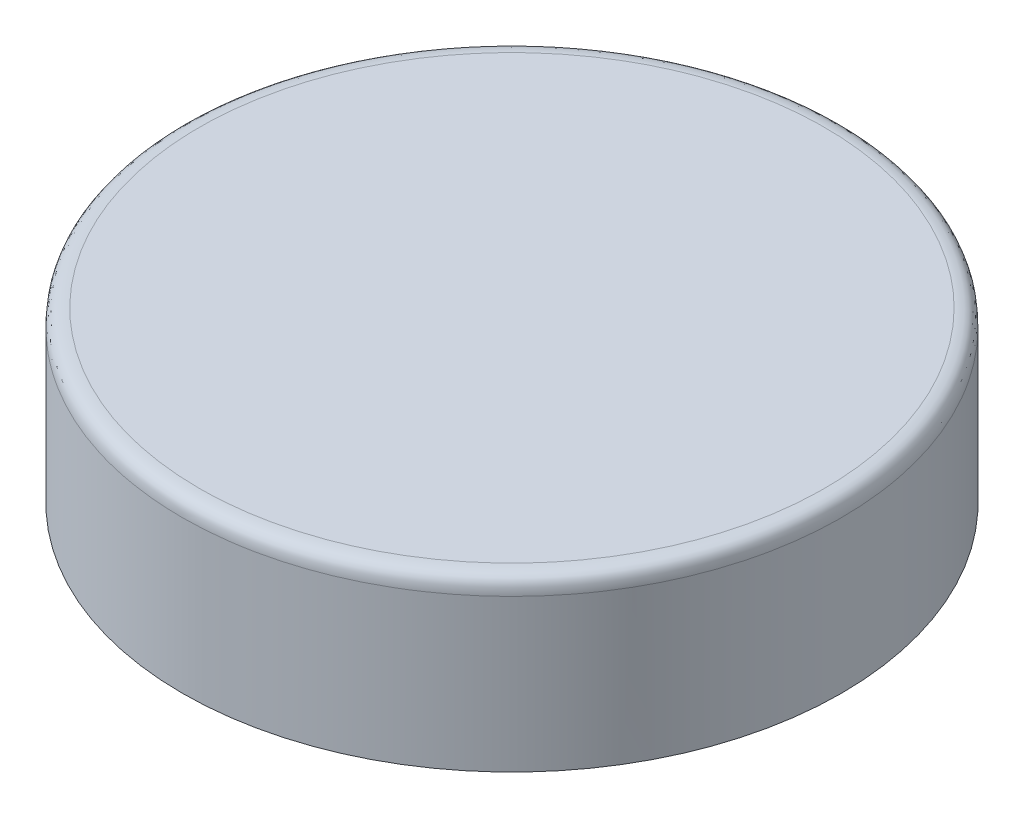
ISO-10303-21;
HEADER;
FILE_DESCRIPTION(('STEP AP214'),'2;1');
FILE_NAME('part.step','',(''),(''),'','','');
FILE_SCHEMA(('AUTOMOTIVE_DESIGN { 1 0 10303 214 1 1 1 1 }'));
ENDSEC;
DATA;
#1=APPLICATION_CONTEXT('core data for automotive mechanical design processes');
#2=APPLICATION_PROTOCOL_DEFINITION('international standard','automotive_design',2000,#1);
#3=PRODUCT_CONTEXT('',#1,'mechanical');
#4=PRODUCT('Part','Part','',(#3));
#5=PRODUCT_RELATED_PRODUCT_CATEGORY('part','',(#4));
#6=PRODUCT_DEFINITION_FORMATION('','',#4);
#7=PRODUCT_DEFINITION_CONTEXT('part definition',#1,'design');
#8=PRODUCT_DEFINITION('design','',#6,#7);
#9=PRODUCT_DEFINITION_SHAPE('','',#8);
#10=(LENGTH_UNIT() NAMED_UNIT(*) SI_UNIT(.MILLI.,.METRE.));
#11=(NAMED_UNIT(*) PLANE_ANGLE_UNIT() SI_UNIT($,.RADIAN.));
#12=(NAMED_UNIT(*) SI_UNIT($,.STERADIAN.) SOLID_ANGLE_UNIT());
#13=UNCERTAINTY_MEASURE_WITH_UNIT(LENGTH_MEASURE(1.E-05),#10,'distance_accuracy_value','');
#14=(GEOMETRIC_REPRESENTATION_CONTEXT(3) GLOBAL_UNCERTAINTY_ASSIGNED_CONTEXT((#13)) GLOBAL_UNIT_ASSIGNED_CONTEXT((#10,
#11,#12)) REPRESENTATION_CONTEXT('',''));
#15=CARTESIAN_POINT('',(0.,0.,0.));
#16=DIRECTION('',(0.,0.,1.));
#17=DIRECTION('',(1.,0.,0.));
#18=AXIS2_PLACEMENT_3D('',#15,#16,#17);
#19=CARTESIAN_POINT('',(34.0011574074074,18.7,-5.12392703793074));
#20=CARTESIAN_POINT('',(34.0011574074074,11.8999999999808,-5.12392703793074));
#21=CARTESIAN_POINT('',(34.0011574074074,5.1,-5.12392703793074));
#22=CARTESIAN_POINT('',(34.0011574074074,-1.7,-5.12392703793074));
#23=CARTESIAN_POINT('',(34.2320146256508,18.7,-5.21398437817317));
#24=CARTESIAN_POINT('',(34.2320146256508,11.8999999999808,-5.21398437817317));
#25=CARTESIAN_POINT('',(34.2320146256508,5.1,-5.21398437817317));
#26=CARTESIAN_POINT('',(34.2320146256508,-1.7,-5.21398437817317));
#27=CARTESIAN_POINT('',(34.493868674793,18.7,-5.30115351592212));
#28=CARTESIAN_POINT('',(34.493868674793,11.8999999999808,-5.30115351592212));
#29=CARTESIAN_POINT('',(34.493868674793,5.1,-5.30115351592212));
#30=CARTESIAN_POINT('',(34.493868674793,-1.7,-5.30115351592212));
#31=CARTESIAN_POINT('',(35.1290291317031,18.7,-5.66636233860913));
#32=CARTESIAN_POINT('',(35.1290291317031,11.8999999999808,-5.66636233860913));
#33=CARTESIAN_POINT('',(35.1290291317031,5.1,-5.66636233860913));
#34=CARTESIAN_POINT('',(35.1290291317031,-1.7,-5.66636233860913));
#35=CARTESIAN_POINT('',(35.3760401845032,18.7,-6.19211694788725));
#36=CARTESIAN_POINT('',(35.3760401845032,11.8999999999808,-6.19211694788725));
#37=CARTESIAN_POINT('',(35.3760401845032,5.1,-6.19211694788725));
#38=CARTESIAN_POINT('',(35.3760401845032,-1.7,-6.19211694788725));
#39=CARTESIAN_POINT('',(35.3507578582114,18.7,-6.81573477498469));
#40=CARTESIAN_POINT('',(35.3507578582114,11.8999999999808,-6.81573477498469));
#41=CARTESIAN_POINT('',(35.3507578582114,5.1,-6.81573477498469));
#42=CARTESIAN_POINT('',(35.3507578582114,-1.7,-6.81573477498469));
#43=CARTESIAN_POINT('',(35.2930109513593,18.7,-7.10581632505651));
#44=CARTESIAN_POINT('',(35.2930109513593,11.8999999999808,-7.10581632505651));
#45=CARTESIAN_POINT('',(35.2930109513593,5.1,-7.10581632505651));
#46=CARTESIAN_POINT('',(35.2930109513593,-1.7,-7.10581632505651));
#47=CARTESIAN_POINT('',(35.2316176470588,18.7,-7.39818342375026));
#48=CARTESIAN_POINT('',(35.2316176470588,11.8999999999808,-7.39818342375026));
#49=CARTESIAN_POINT('',(35.2316176470588,5.1,-7.39818342375026));
#50=CARTESIAN_POINT('',(35.2316176470588,-1.7,-7.39818342375026));
#51=B_SPLINE_SURFACE_WITH_KNOTS('',5,3,((#19,#20,#21,#22),(#23,#24,#25,#26),(#27,#28,#29,#30),
(#31,#32,#33,#34),(#35,#36,#37,#38),(#39,#40,#41,#42),(#43,#44,#45,#46),(#47,#48,#49,#50)),
.UNSPECIFIED.,.F.,.F.,.F.,(6,2,6),(4,4),(0.,0.5,1.),(-0.0017,0.0187),.UNSPECIFIED.);
#52=CARTESIAN_POINT('',(34.0011574074074,-1.7,-5.12392703793074));
#53=CARTESIAN_POINT('',(34.0011574074074,5.1,-5.12392703793074));
#54=CARTESIAN_POINT('',(34.0011574074074,11.8999999999808,-5.12392703793074));
#55=CARTESIAN_POINT('',(34.0011574074074,18.7,-5.12392703793074));
#56=B_SPLINE_CURVE_WITH_KNOTS('',3,(#52,#53,#54,#55),.UNSPECIFIED.,.F.,.F.,(4,4),(-0.0017,
0.0187),.UNSPECIFIED.);
#57=CARTESIAN_POINT('',(34.0011574074074,17.,-5.12392703793074));
#58=VERTEX_POINT('',#57);
#59=CARTESIAN_POINT('',(34.0011574074074,13.8,-5.12392703793074));
#60=VERTEX_POINT('',#59);
#61=EDGE_CURVE('E366',#58,#60,#56,.F.);
#62=CARTESIAN_POINT('',(34.0011574074074,17.,-5.12392703793074));
#63=CARTESIAN_POINT('',(34.2320146256508,17.,-5.21398437817317));
#64=CARTESIAN_POINT('',(34.493868674793,17.,-5.30115351592212));
#65=CARTESIAN_POINT('',(35.1290291317031,17.,-5.66636233860913));
#66=CARTESIAN_POINT('',(35.3760401845032,17.,-6.19211694788725));
#67=CARTESIAN_POINT('',(35.3507578582114,17.,-6.81573477498469));
#68=CARTESIAN_POINT('',(35.2930109513593,17.,-7.10581632505651));
#69=CARTESIAN_POINT('',(35.2316176470588,17.,-7.39818342375026));
#70=B_SPLINE_CURVE_WITH_KNOTS('',5,(#62,#63,#64,#65,#66,#67,#68,#69),.UNSPECIFIED.,.F.,.F.,(6,2,
6),(0.,0.5,1.),.UNSPECIFIED.);
#71=CARTESIAN_POINT('',(35.2316176470588,17.,-7.39818342375027));
#72=VERTEX_POINT('',#71);
#73=EDGE_CURVE('E56',#72,#58,#70,.F.);
#74=CARTESIAN_POINT('',(35.2316176470588,18.7,-7.39818342375026));
#75=CARTESIAN_POINT('',(35.2316176470588,11.8999999999808,-7.39818342375026));
#76=CARTESIAN_POINT('',(35.2316176470588,5.1,-7.39818342375026));
#77=CARTESIAN_POINT('',(35.2316176470588,-1.7,-7.39818342375026));
#78=B_SPLINE_CURVE_WITH_KNOTS('',3,(#74,#75,#76,#77),.UNSPECIFIED.,.F.,.F.,(4,4),(-0.0017,
0.0187),.UNSPECIFIED.);
#79=CARTESIAN_POINT('',(35.2316176470588,13.8,-7.39818342375027));
#80=VERTEX_POINT('',#79);
#81=EDGE_CURVE('E263',#80,#72,#78,.F.);
#82=CARTESIAN_POINT('',(35.2316176470588,13.8,-7.39818342375026));
#83=CARTESIAN_POINT('',(35.2930109513593,13.8,-7.10581632505651));
#84=CARTESIAN_POINT('',(35.3507578582114,13.8,-6.81573477498469));
#85=CARTESIAN_POINT('',(35.3760401845032,13.8,-6.19211694788725));
#86=CARTESIAN_POINT('',(35.1290291317031,13.8,-5.66636233860913));
#87=CARTESIAN_POINT('',(34.493868674793,13.8,-5.30115351592212));
#88=CARTESIAN_POINT('',(34.2320146256508,13.8,-5.21398437817317));
#89=CARTESIAN_POINT('',(34.0011574074074,13.8,-5.12392703793074));
#90=B_SPLINE_CURVE_WITH_KNOTS('',5,(#82,#83,#84,#85,#86,#87,#88,#89),.UNSPECIFIED.,.F.,.F.,(6,2,
6),(0.,0.5,1.),.UNSPECIFIED.);
#91=EDGE_CURVE('E11',#80,#60,#90,.T.);
#92=ORIENTED_EDGE('',*,*,#61,.F.);
#93=ORIENTED_EDGE('',*,*,#73,.F.);
#94=ORIENTED_EDGE('',*,*,#81,.F.);
#95=ORIENTED_EDGE('',*,*,#91,.T.);
#96=EDGE_LOOP('',(#92,#93,#94,#95));
#97=FACE_BOUND('',#96,.T.);
#98=ADVANCED_FACE('F42',(#97),#51,.T.);
#99=CARTESIAN_POINT('',(34.0011574074074,-1.7,5.12392703793074));
#100=CARTESIAN_POINT('',(34.0011574074074,5.1,5.12392703793074));
#101=CARTESIAN_POINT('',(34.0011574074074,11.8999999999808,5.12392703793074));
#102=CARTESIAN_POINT('',(34.0011574074074,18.7,5.12392703793074));
#103=CARTESIAN_POINT('',(34.2320146256508,-1.7,5.21398437817317));
#104=CARTESIAN_POINT('',(34.2320146256508,5.1,5.21398437817317));
#105=CARTESIAN_POINT('',(34.2320146256508,11.8999999999808,5.21398437817317));
#106=CARTESIAN_POINT('',(34.2320146256508,18.7,5.21398437817317));
#107=CARTESIAN_POINT('',(34.493868674793,-1.7,5.30115351592212));
#108=CARTESIAN_POINT('',(34.493868674793,5.1,5.30115351592212));
#109=CARTESIAN_POINT('',(34.493868674793,11.8999999999808,5.30115351592212));
#110=CARTESIAN_POINT('',(34.493868674793,18.7,5.30115351592212));
#111=CARTESIAN_POINT('',(35.1290291317031,-1.7,5.66636233860913));
#112=CARTESIAN_POINT('',(35.1290291317031,5.1,5.66636233860913));
#113=CARTESIAN_POINT('',(35.1290291317031,11.8999999999808,5.66636233860913));
#114=CARTESIAN_POINT('',(35.1290291317031,18.7,5.66636233860913));
#115=CARTESIAN_POINT('',(35.3760401845032,-1.7,6.19211694788725));
#116=CARTESIAN_POINT('',(35.3760401845032,5.1,6.19211694788725));
#117=CARTESIAN_POINT('',(35.3760401845032,11.8999999999808,6.19211694788725));
#118=CARTESIAN_POINT('',(35.3760401845032,18.7,6.19211694788725));
#119=CARTESIAN_POINT('',(35.3507578582114,-1.7,6.81573477498469));
#120=CARTESIAN_POINT('',(35.3507578582114,5.1,6.81573477498469));
#121=CARTESIAN_POINT('',(35.3507578582114,11.8999999999808,6.81573477498469));
#122=CARTESIAN_POINT('',(35.3507578582114,18.7,6.81573477498469));
#123=CARTESIAN_POINT('',(35.2930109513593,-1.7,7.10581632505651));
#124=CARTESIAN_POINT('',(35.2930109513593,5.1,7.10581632505651));
#125=CARTESIAN_POINT('',(35.2930109513593,11.8999999999808,7.10581632505651));
#126=CARTESIAN_POINT('',(35.2930109513593,18.7,7.10581632505651));
#127=CARTESIAN_POINT('',(35.2316176470588,-1.7,7.39818342375026));
#128=CARTESIAN_POINT('',(35.2316176470588,5.1,7.39818342375026));
#129=CARTESIAN_POINT('',(35.2316176470588,11.8999999999808,7.39818342375026));
#130=CARTESIAN_POINT('',(35.2316176470588,18.7,7.39818342375026));
#131=B_SPLINE_SURFACE_WITH_KNOTS('',5,3,((#99,#100,#101,#102),(#103,#104,#105,#106),(#107,#108,
#109,#110),(#111,#112,#113,#114),(#115,#116,#117,#118),(#119,#120,#121,#122),(#123,#124,#125,
#126),(#127,#128,#129,#130)),.UNSPECIFIED.,.F.,.F.,.F.,(6,2,6),(4,4),(0.,0.5,1.),(-0.0187,
0.0017),.UNSPECIFIED.);
#132=CARTESIAN_POINT('',(34.0011574074074,18.7,5.12392703793074));
#133=CARTESIAN_POINT('',(34.0011574074074,11.8999999999808,5.12392703793074));
#134=CARTESIAN_POINT('',(34.0011574074074,5.1,5.12392703793074));
#135=CARTESIAN_POINT('',(34.0011574074074,-1.7,5.12392703793074));
#136=B_SPLINE_CURVE_WITH_KNOTS('',3,(#132,#133,#134,#135),.UNSPECIFIED.,.F.,.F.,(4,4),(-0.0187,
0.0017),.UNSPECIFIED.);
#137=CARTESIAN_POINT('',(34.0011574074074,13.8,5.12392703793074));
#138=VERTEX_POINT('',#137);
#139=CARTESIAN_POINT('',(34.0011574074074,17.,5.12392703793074));
#140=VERTEX_POINT('',#139);
#141=EDGE_CURVE('E314',#138,#140,#136,.F.);
#142=CARTESIAN_POINT('',(34.0011574074074,13.8,5.12392703793074));
#143=CARTESIAN_POINT('',(34.2320146256508,13.8,5.21398437817317));
#144=CARTESIAN_POINT('',(34.493868674793,13.8,5.30115351592212));
#145=CARTESIAN_POINT('',(35.1290291317031,13.8,5.66636233860913));
#146=CARTESIAN_POINT('',(35.3760401845032,13.8,6.19211694788725));
#147=CARTESIAN_POINT('',(35.3507578582114,13.8,6.81573477498469));
#148=CARTESIAN_POINT('',(35.2930109513593,13.8,7.10581632505651));
#149=CARTESIAN_POINT('',(35.2316176470588,13.8,7.39818342375026));
#150=B_SPLINE_CURVE_WITH_KNOTS('',5,(#142,#143,#144,#145,#146,#147,#148,#149),.UNSPECIFIED.,.F.,
.F.,(6,2,6),(0.,0.5,1.),.UNSPECIFIED.);
#151=CARTESIAN_POINT('',(35.2316176470588,13.8,7.39818342375027));
#152=VERTEX_POINT('',#151);
#153=EDGE_CURVE('E361',#138,#152,#150,.T.);
#154=CARTESIAN_POINT('',(35.2316176470588,-1.7,7.39818342375026));
#155=CARTESIAN_POINT('',(35.2316176470588,5.1,7.39818342375026));
#156=CARTESIAN_POINT('',(35.2316176470588,11.8999999999808,7.39818342375026));
#157=CARTESIAN_POINT('',(35.2316176470588,18.7,7.39818342375026));
#158=B_SPLINE_CURVE_WITH_KNOTS('',3,(#154,#155,#156,#157),.UNSPECIFIED.,.F.,.F.,(4,4),(-0.0187,
0.0017),.UNSPECIFIED.);
#159=CARTESIAN_POINT('',(35.2316176470588,17.,7.39818342375027));
#160=VERTEX_POINT('',#159);
#161=EDGE_CURVE('E362',#160,#152,#158,.F.);
#162=CARTESIAN_POINT('',(35.2316176470588,17.,7.39818342375026));
#163=CARTESIAN_POINT('',(35.2930109513593,17.,7.10581632505651));
#164=CARTESIAN_POINT('',(35.3507578582114,17.,6.81573477498469));
#165=CARTESIAN_POINT('',(35.3760401845032,17.,6.19211694788725));
#166=CARTESIAN_POINT('',(35.1290291317031,17.,5.66636233860913));
#167=CARTESIAN_POINT('',(34.493868674793,17.,5.30115351592212));
#168=CARTESIAN_POINT('',(34.2320146256508,17.,5.21398437817317));
#169=CARTESIAN_POINT('',(34.0011574074074,17.,5.12392703793074));
#170=B_SPLINE_CURVE_WITH_KNOTS('',5,(#162,#163,#164,#165,#166,#167,#168,#169),.UNSPECIFIED.,.F.,
.F.,(6,2,6),(0.,0.5,1.),.UNSPECIFIED.);
#171=EDGE_CURVE('E299',#140,#160,#170,.F.);
#172=ORIENTED_EDGE('',*,*,#141,.F.);
#173=ORIENTED_EDGE('',*,*,#153,.T.);
#174=ORIENTED_EDGE('',*,*,#161,.F.);
#175=ORIENTED_EDGE('',*,*,#171,.F.);
#176=EDGE_LOOP('',(#172,#173,#174,#175));
#177=FACE_BOUND('',#176,.T.);
#178=ADVANCED_FACE('F320',(#177),#131,.T.);
#179=CARTESIAN_POINT('',(0.,17.,0.));
#180=DIRECTION('',(0.,1.,0.));
#181=DIRECTION('',(0.,0.,1.));
#182=AXIS2_PLACEMENT_3D('',#179,#180,#181);
#183=PLANE('',#182);
#184=CARTESIAN_POINT('',(0.,17.,0.));
#185=DIRECTION('',(0.,1.,0.));
#186=DIRECTION('',(0.,0.,1.));
#187=AXIS2_PLACEMENT_3D('',#184,#185,#186);
#188=CIRCLE('',#187,36.);
#189=CARTESIAN_POINT('',(16.2103086746704,17.,-32.143831331562));
#190=VERTEX_POINT('',#189);
#191=EDGE_CURVE('E142',#72,#190,#188,.T.);
#192=ORIENTED_EDGE('',*,*,#191,.F.);
#193=ORIENTED_EDGE('',*,*,#73,.T.);
#194=CARTESIAN_POINT('',(36.,17.,0.));
#195=DIRECTION('',(0.,-1.,0.));
#196=DIRECTION('',(0.,0.,-1.));
#197=AXIS2_PLACEMENT_3D('',#194,#195,#196);
#198=CIRCLE('',#197,5.5);
#199=EDGE_CURVE('E231',#58,#140,#198,.F.);
#200=ORIENTED_EDGE('',*,*,#199,.T.);
#201=ORIENTED_EDGE('',*,*,#171,.T.);
#202=CARTESIAN_POINT('',(16.2103086746709,17.,32.1438313315617));
#203=VERTEX_POINT('',#202);
#204=EDGE_CURVE('E254',#203,#160,#188,.T.);
#205=ORIENTED_EDGE('',*,*,#204,.F.);
#206=CARTESIAN_POINT('',(11.1246117974985,17.,34.2380345866254));
#207=DIRECTION('',(0.,-1.,0.));
#208=DIRECTION('',(0.,0.,-1.));
#209=AXIS2_PLACEMENT_3D('',#206,#207,#208);
#210=CIRCLE('',#209,5.5);
#211=CARTESIAN_POINT('',(5.77925480699717,17.,35.5330861856355));
#212=VERTEX_POINT('',#211);
#213=EDGE_CURVE('E211',#203,#212,#210,.F.);
#214=ORIENTED_EDGE('',*,*,#213,.T.);
#215=CARTESIAN_POINT('',(-25.5613393820373,17.,25.349909841976));
#216=VERTEX_POINT('',#215);
#217=EDGE_CURVE('E249',#216,#212,#188,.T.);
#218=ORIENTED_EDGE('',*,*,#217,.F.);
#219=CARTESIAN_POINT('',(-29.1246117974979,17.,21.1602690825293));
#220=DIRECTION('',(0.,-1.,0.));
#221=DIRECTION('',(0.,0.,-1.));
#222=AXIS2_PLACEMENT_3D('',#219,#220,#221);
#223=CIRCLE('',#222,5.5);
#224=CARTESIAN_POINT('',(-32.0080852107407,17.,16.4767254374757));
#225=VERTEX_POINT('',#224);
#226=EDGE_CURVE('E191',#216,#225,#223,.F.);
#227=ORIENTED_EDGE('',*,*,#226,.T.);
#228=CARTESIAN_POINT('',(-32.008085210741,17.,-16.4767254374753));
#229=VERTEX_POINT('',#228);
#230=EDGE_CURVE('E248',#229,#225,#188,.T.);
#231=ORIENTED_EDGE('',*,*,#230,.F.);
#232=CARTESIAN_POINT('',(-29.1246117974982,17.,-21.1602690825289));
#233=DIRECTION('',(0.,-1.,0.));
#234=DIRECTION('',(0.,0.,-1.));
#235=AXIS2_PLACEMENT_3D('',#232,#233,#234);
#236=CIRCLE('',#235,5.5);
#237=CARTESIAN_POINT('',(-25.5613393820376,17.,-25.3499098419756));
#238=VERTEX_POINT('',#237);
#239=EDGE_CURVE('E171',#229,#238,#236,.F.);
#240=ORIENTED_EDGE('',*,*,#239,.T.);
#241=CARTESIAN_POINT('',(5.77925480699667,17.,-35.5330861856356));
#242=VERTEX_POINT('',#241);
#243=EDGE_CURVE('E245',#242,#238,#188,.T.);
#244=ORIENTED_EDGE('',*,*,#243,.F.);
#245=CARTESIAN_POINT('',(11.124611797498,17.,-34.2380345866256));
#246=DIRECTION('',(0.,-1.,0.));
#247=DIRECTION('',(0.,0.,-1.));
#248=AXIS2_PLACEMENT_3D('',#245,#246,#247);
#249=CIRCLE('',#248,5.5);
#250=EDGE_CURVE('E158',#242,#190,#249,.F.);
#251=ORIENTED_EDGE('',*,*,#250,.T.);
#252=EDGE_LOOP('',(#192,#193,#200,#201,#205,#214,#218,#227,#231,#240,#244,#251));
#253=FACE_BOUND('',#252,.T.);
#254=ADVANCED_FACE('F334',(#253),#183,.F.);
#255=CARTESIAN_POINT('',(0.,0.,0.));
#256=DIRECTION('',(0.,1.,0.));
#257=DIRECTION('',(0.,0.,1.));
#258=AXIS2_PLACEMENT_3D('',#255,#256,#257);
#259=PLANE('',#258);
#260=CARTESIAN_POINT('',(0.,0.,0.));
#261=DIRECTION('',(0.,1.,0.));
#262=DIRECTION('',(0.,0.,1.));
#263=AXIS2_PLACEMENT_3D('',#260,#261,#262);
#264=CIRCLE('',#263,39.);
#265=CARTESIAN_POINT('',(0.,0.,39.));
#266=VERTEX_POINT('',#265);
#267=EDGE_CURVE('E377',#266,#266,#264,.T.);
#268=ORIENTED_EDGE('',*,*,#267,.F.);
#269=EDGE_LOOP('',(#268));
#270=FACE_BOUND('',#269,.T.);
#271=CARTESIAN_POINT('',(0.,0.,0.));
#272=DIRECTION('',(0.,1.,0.));
#273=DIRECTION('',(0.,0.,1.));
#274=AXIS2_PLACEMENT_3D('',#271,#272,#273);
#275=CIRCLE('',#274,36.);
#276=CARTESIAN_POINT('',(0.,0.,36.));
#277=VERTEX_POINT('',#276);
#278=EDGE_CURVE('E250',#277,#277,#275,.T.);
#279=ORIENTED_EDGE('',*,*,#278,.T.);
#280=EDGE_LOOP('',(#279));
#281=FACE_BOUND('',#280,.T.);
#282=ADVANCED_FACE('F283',(#270,#281),#259,.F.);
#283=CARTESIAN_POINT('',(0.,17.,0.));
#284=DIRECTION('',(0.,-1.,0.));
#285=DIRECTION('',(0.,0.,-1.));
#286=AXIS2_PLACEMENT_3D('',#283,#284,#285);
#287=CYLINDRICAL_SURFACE('',#286,39.);
#288=CARTESIAN_POINT('',(0.,18.,39.));
#289=CARTESIAN_POINT('',(5.10440108639493,18.,39.));
#290=CARTESIAN_POINT('',(15.3132032591848,18.,36.9693429916998));
#291=CARTESIAN_POINT('',(28.2951101366919,18.,28.2951101366919));
#292=CARTESIAN_POINT('',(36.9693429916998,18.,15.3132032591847));
#293=CARTESIAN_POINT('',(40.0153285041501,18.,0.));
#294=CARTESIAN_POINT('',(36.9693429916998,18.,-15.3132032591848));
#295=CARTESIAN_POINT('',(28.2951101366918,18.,-28.2951101366919));
#296=CARTESIAN_POINT('',(15.3132032591849,18.,-36.9693429916998));
#297=CARTESIAN_POINT('',(0.,18.,-40.0153285041501));
#298=CARTESIAN_POINT('',(-15.3132032591847,18.,-36.9693429916998));
#299=CARTESIAN_POINT('',(-28.295110136692,18.,-28.2951101366918));
#300=CARTESIAN_POINT('',(-36.9693429916997,18.,-15.3132032591849));
#301=CARTESIAN_POINT('',(-40.0153285041501,18.,1.62972997915268E-13));
#302=CARTESIAN_POINT('',(-36.9693429916998,18.,15.3132032591847));
#303=CARTESIAN_POINT('',(-28.295110136692,18.,28.2951101366918));
#304=CARTESIAN_POINT('',(-15.3132032591848,18.,36.9693429916998));
#305=CARTESIAN_POINT('',(-5.10440108639493,18.,39.));
#306=CARTESIAN_POINT('',(0.,18.,39.));
#307=B_SPLINE_CURVE_WITH_KNOTS('',3,(#288,#289,#290,#291,#292,#293,#294,#295,#296,#297,#298,
#299,#300,#301,#302,#303,#304,#305,#306),.UNSPECIFIED.,.T.,.F.,(4,1,1,1,1,1,1,1,1,1,1,1,1,1,1,1,
4),(0.,0.392699081698724,0.785398163397448,1.17809724509617,1.5707963267949,1.96349540849362,
2.35619449019234,2.74889357189107,3.14159265358979,3.53429173528852,3.92699081698724,
4.31968989868597,4.71238898038469,5.10508806208341,5.49778714378214,5.89048622548086,
6.28318530717959),.UNSPECIFIED.);
#308=CARTESIAN_POINT('',(0.,18.,39.));
#309=VERTEX_POINT('',#308);
#310=EDGE_CURVE('E367',#309,#309,#307,.F.);
#311=ORIENTED_EDGE('',*,*,#310,.T.);
#312=EDGE_LOOP('',(#311));
#313=FACE_BOUND('',#312,.T.);
#314=ORIENTED_EDGE('',*,*,#267,.T.);
#315=EDGE_LOOP('',(#314));
#316=FACE_BOUND('',#315,.T.);
#317=ADVANCED_FACE('F279',(#313,#316),#287,.T.);
#318=CARTESIAN_POINT('',(0.,17.,0.));
#319=DIRECTION('',(0.,-1.,0.));
#320=DIRECTION('',(0.,0.,-1.));
#321=AXIS2_PLACEMENT_3D('',#318,#319,#320);
#322=CYLINDRICAL_SURFACE('',#321,36.);
#323=CARTESIAN_POINT('',(0.,13.8,0.));
#324=DIRECTION('',(0.,-1.,0.));
#325=DIRECTION('',(0.,0.,-1.));
#326=AXIS2_PLACEMENT_3D('',#323,#324,#325);
#327=CIRCLE('',#326,36.);
#328=EDGE_CURVE('E63',#80,#152,#327,.T.);
#329=ORIENTED_EDGE('',*,*,#328,.F.);
#330=ORIENTED_EDGE('',*,*,#81,.T.);
#331=ORIENTED_EDGE('',*,*,#191,.T.);
#332=DIRECTION('',(0.,1.,0.));
#333=VECTOR('',#332,1.);
#334=CARTESIAN_POINT('',(16.2103086746704,13.8,-32.143831331562));
#335=LINE('',#334,#333);
#336=CARTESIAN_POINT('',(16.2103086746704,13.8,-32.143831331562));
#337=VERTEX_POINT('',#336);
#338=EDGE_CURVE('E135',#337,#190,#335,.T.);
#339=ORIENTED_EDGE('',*,*,#338,.F.);
#340=CARTESIAN_POINT('',(0.,13.8,0.));
#341=DIRECTION('',(0.,-1.,0.));
#342=DIRECTION('',(0.,0.,-1.));
#343=AXIS2_PLACEMENT_3D('',#340,#341,#342);
#344=CIRCLE('',#343,36.);
#345=CARTESIAN_POINT('',(5.77925480699667,13.8,-35.5330861856356));
#346=VERTEX_POINT('',#345);
#347=EDGE_CURVE('E139',#346,#337,#344,.T.);
#348=ORIENTED_EDGE('',*,*,#347,.F.);
#349=DIRECTION('',(0.,1.,0.));
#350=VECTOR('',#349,1.);
#351=CARTESIAN_POINT('',(5.77925480699668,13.8,-35.5330861856356));
#352=LINE('',#351,#350);
#353=EDGE_CURVE('E147',#346,#242,#352,.T.);
#354=ORIENTED_EDGE('',*,*,#353,.T.);
#355=ORIENTED_EDGE('',*,*,#243,.T.);
#356=DIRECTION('',(0.,1.,0.));
#357=VECTOR('',#356,1.);
#358=CARTESIAN_POINT('',(-25.5613393820376,13.8,-25.3499098419756));
#359=LINE('',#358,#357);
#360=CARTESIAN_POINT('',(-25.5613393820376,13.8,-25.3499098419756));
#361=VERTEX_POINT('',#360);
#362=EDGE_CURVE('E177',#361,#238,#359,.T.);
#363=ORIENTED_EDGE('',*,*,#362,.F.);
#364=CARTESIAN_POINT('',(0.,13.8,0.));
#365=DIRECTION('',(0.,-1.,0.));
#366=DIRECTION('',(0.,0.,-1.));
#367=AXIS2_PLACEMENT_3D('',#364,#365,#366);
#368=CIRCLE('',#367,36.);
#369=CARTESIAN_POINT('',(-32.008085210741,13.8,-16.4767254374753));
#370=VERTEX_POINT('',#369);
#371=EDGE_CURVE('E174',#370,#361,#368,.T.);
#372=ORIENTED_EDGE('',*,*,#371,.F.);
#373=DIRECTION('',(0.,1.,0.));
#374=VECTOR('',#373,1.);
#375=CARTESIAN_POINT('',(-32.008085210741,13.8,-16.4767254374753));
#376=LINE('',#375,#374);
#377=EDGE_CURVE('E184',#370,#229,#376,.T.);
#378=ORIENTED_EDGE('',*,*,#377,.T.);
#379=ORIENTED_EDGE('',*,*,#230,.T.);
#380=DIRECTION('',(0.,1.,0.));
#381=VECTOR('',#380,1.);
#382=CARTESIAN_POINT('',(-32.0080852107407,13.8,16.4767254374757));
#383=LINE('',#382,#381);
#384=CARTESIAN_POINT('',(-32.0080852107407,13.8,16.4767254374757));
#385=VERTEX_POINT('',#384);
#386=EDGE_CURVE('E197',#385,#225,#383,.T.);
#387=ORIENTED_EDGE('',*,*,#386,.F.);
#388=CARTESIAN_POINT('',(0.,13.8,0.));
#389=DIRECTION('',(0.,-1.,0.));
#390=DIRECTION('',(0.,0.,-1.));
#391=AXIS2_PLACEMENT_3D('',#388,#389,#390);
#392=CIRCLE('',#391,36.);
#393=CARTESIAN_POINT('',(-25.5613393820373,13.8,25.349909841976));
#394=VERTEX_POINT('',#393);
#395=EDGE_CURVE('E194',#394,#385,#392,.T.);
#396=ORIENTED_EDGE('',*,*,#395,.F.);
#397=DIRECTION('',(0.,1.,0.));
#398=VECTOR('',#397,1.);
#399=CARTESIAN_POINT('',(-25.5613393820373,13.8,25.349909841976));
#400=LINE('',#399,#398);
#401=EDGE_CURVE('E204',#394,#216,#400,.T.);
#402=ORIENTED_EDGE('',*,*,#401,.T.);
#403=ORIENTED_EDGE('',*,*,#217,.T.);
#404=DIRECTION('',(0.,1.,0.));
#405=VECTOR('',#404,1.);
#406=CARTESIAN_POINT('',(5.77925480699717,13.8,35.5330861856355));
#407=LINE('',#406,#405);
#408=CARTESIAN_POINT('',(5.77925480699717,13.8,35.5330861856355));
#409=VERTEX_POINT('',#408);
#410=EDGE_CURVE('E217',#409,#212,#407,.T.);
#411=ORIENTED_EDGE('',*,*,#410,.F.);
#412=CARTESIAN_POINT('',(0.,13.8,0.));
#413=DIRECTION('',(0.,-1.,0.));
#414=DIRECTION('',(0.,0.,-1.));
#415=AXIS2_PLACEMENT_3D('',#412,#413,#414);
#416=CIRCLE('',#415,36.);
#417=CARTESIAN_POINT('',(16.2103086746709,13.8,32.1438313315617));
#418=VERTEX_POINT('',#417);
#419=EDGE_CURVE('E214',#418,#409,#416,.T.);
#420=ORIENTED_EDGE('',*,*,#419,.F.);
#421=DIRECTION('',(0.,1.,0.));
#422=VECTOR('',#421,1.);
#423=CARTESIAN_POINT('',(16.2103086746709,13.8,32.1438313315617));
#424=LINE('',#423,#422);
#425=EDGE_CURVE('E224',#418,#203,#424,.T.);
#426=ORIENTED_EDGE('',*,*,#425,.T.);
#427=ORIENTED_EDGE('',*,*,#204,.T.);
#428=ORIENTED_EDGE('',*,*,#161,.T.);
#429=EDGE_LOOP('',(#329,#330,#331,#339,#348,#354,#355,#363,#372,#378,#379,#387,#396,#402,#403,
#411,#420,#426,#427,#428));
#430=FACE_BOUND('',#429,.T.);
#431=ORIENTED_EDGE('',*,*,#278,.F.);
#432=EDGE_LOOP('',(#431));
#433=FACE_BOUND('',#432,.T.);
#434=ADVANCED_FACE('F137',(#430,#433),#322,.F.);
#435=CARTESIAN_POINT('',(0.,20.,0.));
#436=DIRECTION('',(0.,1.,0.));
#437=DIRECTION('',(0.,0.,1.));
#438=AXIS2_PLACEMENT_3D('',#435,#436,#437);
#439=PLANE('',#438);
#440=CARTESIAN_POINT('',(0.,20.,37.));
#441=CARTESIAN_POINT('',(-4.84263692811827,20.,37.));
#442=CARTESIAN_POINT('',(-14.5279107843548,20.,35.0734792485357));
#443=CARTESIAN_POINT('',(-26.8440788476309,20.,26.8440788476307));
#444=CARTESIAN_POINT('',(-35.0734792485357,20.,14.5279107843547));
#445=CARTESIAN_POINT('',(-37.9632603757322,20.,1.53310343334697E-13));
#446=CARTESIAN_POINT('',(-35.0734792485356,20.,-14.5279107843549));
#447=CARTESIAN_POINT('',(-26.8440788476308,20.,-26.8440788476307));
#448=CARTESIAN_POINT('',(-14.5279107843547,20.,-35.0734792485357));
#449=CARTESIAN_POINT('',(0.,20.,-37.9632603757321));
#450=CARTESIAN_POINT('',(14.5279107843549,20.,-35.0734792485356));
#451=CARTESIAN_POINT('',(26.8440788476307,20.,-26.8440788476308));
#452=CARTESIAN_POINT('',(35.0734792485357,20.,-14.5279107843548));
#453=CARTESIAN_POINT('',(37.9632603757322,20.,0.));
#454=CARTESIAN_POINT('',(35.0734792485357,20.,14.5279107843548));
#455=CARTESIAN_POINT('',(26.8440788476308,20.,26.8440788476308));
#456=CARTESIAN_POINT('',(14.5279107843548,20.,35.0734792485357));
#457=CARTESIAN_POINT('',(4.84263692811827,20.,37.));
#458=CARTESIAN_POINT('',(0.,20.,37.));
#459=B_SPLINE_CURVE_WITH_KNOTS('',3,(#440,#441,#442,#443,#444,#445,#446,#447,#448,#449,#450,
#451,#452,#453,#454,#455,#456,#457,#458),.UNSPECIFIED.,.T.,.F.,(4,1,1,1,1,1,1,1,1,1,1,1,1,1,1,1,
4),(0.,0.392699081698724,0.785398163397448,1.17809724509617,1.5707963267949,1.96349540849362,
2.35619449019235,2.74889357189107,3.14159265358979,3.53429173528852,3.92699081698724,
4.31968989868597,4.71238898038469,5.10508806208341,5.49778714378214,5.89048622548086,
6.28318530717959),.UNSPECIFIED.);
#460=CARTESIAN_POINT('',(0.,20.,37.));
#461=VERTEX_POINT('',#460);
#462=EDGE_CURVE('E372',#461,#461,#459,.F.);
#463=ORIENTED_EDGE('',*,*,#462,.T.);
#464=EDGE_LOOP('',(#463));
#465=FACE_BOUND('',#464,.T.);
#466=ADVANCED_FACE('F278',(#465),#439,.T.);
#467=CARTESIAN_POINT('',(36.,13.8,0.));
#468=DIRECTION('',(0.,1.,0.));
#469=DIRECTION('',(0.,0.,1.));
#470=AXIS2_PLACEMENT_3D('',#467,#468,#469);
#471=CYLINDRICAL_SURFACE('',#470,5.5);
#472=ORIENTED_EDGE('',*,*,#199,.F.);
#473=ORIENTED_EDGE('',*,*,#61,.T.);
#474=CARTESIAN_POINT('',(36.,13.8,0.));
#475=DIRECTION('',(0.,-1.,0.));
#476=DIRECTION('',(0.,0.,-1.));
#477=AXIS2_PLACEMENT_3D('',#474,#475,#476);
#478=CIRCLE('',#477,5.5);
#479=EDGE_CURVE('E230',#60,#138,#478,.F.);
#480=ORIENTED_EDGE('',*,*,#479,.T.);
#481=ORIENTED_EDGE('',*,*,#141,.T.);
#482=EDGE_LOOP('',(#472,#473,#480,#481));
#483=FACE_BOUND('',#482,.T.);
#484=ADVANCED_FACE('F397',(#483),#471,.T.);
#485=CARTESIAN_POINT('',(33.,13.8,0.));
#486=DIRECTION('',(0.,1.,0.));
#487=DIRECTION('',(0.,0.,1.));
#488=AXIS2_PLACEMENT_3D('',#485,#486,#487);
#489=CYLINDRICAL_SURFACE('',#488,1.5);
#490=CARTESIAN_POINT('',(33.,13.8,0.));
#491=DIRECTION('',(0.,-1.,0.));
#492=DIRECTION('',(0.,0.,-1.));
#493=AXIS2_PLACEMENT_3D('',#490,#491,#492);
#494=CIRCLE('',#493,1.5);
#495=CARTESIAN_POINT('',(33.,13.8,-1.5));
#496=VERTEX_POINT('',#495);
#497=EDGE_CURVE('E227',#496,#496,#494,.T.);
#498=ORIENTED_EDGE('',*,*,#497,.T.);
#499=EDGE_LOOP('',(#498));
#500=FACE_BOUND('',#499,.T.);
#501=CARTESIAN_POINT('',(33.,17.,0.));
#502=DIRECTION('',(0.,-1.,0.));
#503=DIRECTION('',(0.,0.,-1.));
#504=AXIS2_PLACEMENT_3D('',#501,#502,#503);
#505=CIRCLE('',#504,1.5);
#506=CARTESIAN_POINT('',(33.,17.,-1.5));
#507=VERTEX_POINT('',#506);
#508=EDGE_CURVE('E226',#507,#507,#505,.T.);
#509=ORIENTED_EDGE('',*,*,#508,.F.);
#510=EDGE_LOOP('',(#509));
#511=FACE_BOUND('',#510,.T.);
#512=ADVANCED_FACE('F398',(#500,#511),#489,.F.);
#513=CARTESIAN_POINT('',(0.,13.8,0.));
#514=DIRECTION('',(0.,-1.,0.));
#515=DIRECTION('',(0.,0.,-1.));
#516=AXIS2_PLACEMENT_3D('',#513,#514,#515);
#517=PLANE('',#516);
#518=ORIENTED_EDGE('',*,*,#497,.F.);
#519=EDGE_LOOP('',(#518));
#520=FACE_BOUND('',#519,.T.);
#521=ORIENTED_EDGE('',*,*,#479,.F.);
#522=ORIENTED_EDGE('',*,*,#91,.F.);
#523=ORIENTED_EDGE('',*,*,#328,.T.);
#524=ORIENTED_EDGE('',*,*,#153,.F.);
#525=EDGE_LOOP('',(#521,#522,#523,#524));
#526=FACE_BOUND('',#525,.T.);
#527=ADVANCED_FACE('F400',(#520,#526),#517,.T.);
#528=ORIENTED_EDGE('',*,*,#508,.T.);
#529=EDGE_LOOP('',(#528));
#530=FACE_BOUND('',#529,.T.);
#531=ADVANCED_FACE('F280',(#530),#183,.F.);
#532=CARTESIAN_POINT('',(11.1246117974985,13.8,34.2380345866254));
#533=DIRECTION('',(0.,1.,0.));
#534=DIRECTION('',(0.,0.,1.));
#535=AXIS2_PLACEMENT_3D('',#532,#533,#534);
#536=CYLINDRICAL_SURFACE('',#535,5.5);
#537=ORIENTED_EDGE('',*,*,#213,.F.);
#538=ORIENTED_EDGE('',*,*,#425,.F.);
#539=CARTESIAN_POINT('',(11.1246117974985,13.8,34.2380345866254));
#540=DIRECTION('',(0.,-1.,0.));
#541=DIRECTION('',(0.,0.,-1.));
#542=AXIS2_PLACEMENT_3D('',#539,#540,#541);
#543=CIRCLE('',#542,5.5);
#544=EDGE_CURVE('E210',#418,#409,#543,.F.);
#545=ORIENTED_EDGE('',*,*,#544,.T.);
#546=ORIENTED_EDGE('',*,*,#410,.T.);
#547=EDGE_LOOP('',(#537,#538,#545,#546));
#548=FACE_BOUND('',#547,.T.);
#549=ADVANCED_FACE('F502',(#548),#536,.T.);
#550=CARTESIAN_POINT('',(10.1975608143736,13.8,31.38486503774));
#551=DIRECTION('',(0.,1.,0.));
#552=DIRECTION('',(0.,0.,1.));
#553=AXIS2_PLACEMENT_3D('',#550,#551,#552);
#554=CYLINDRICAL_SURFACE('',#553,1.5);
#555=CARTESIAN_POINT('',(10.1975608143736,13.8,31.38486503774));
#556=DIRECTION('',(0.,-1.,0.));
#557=DIRECTION('',(0.,0.,-1.));
#558=AXIS2_PLACEMENT_3D('',#555,#556,#557);
#559=CIRCLE('',#558,1.5);
#560=CARTESIAN_POINT('',(10.1975608143736,13.8,29.8848650377399));
#561=VERTEX_POINT('',#560);
#562=EDGE_CURVE('E207',#561,#561,#559,.T.);
#563=ORIENTED_EDGE('',*,*,#562,.T.);
#564=EDGE_LOOP('',(#563));
#565=FACE_BOUND('',#564,.T.);
#566=CARTESIAN_POINT('',(10.1975608143736,17.,31.38486503774));
#567=DIRECTION('',(0.,-1.,0.));
#568=DIRECTION('',(0.,0.,-1.));
#569=AXIS2_PLACEMENT_3D('',#566,#567,#568);
#570=CIRCLE('',#569,1.5);
#571=CARTESIAN_POINT('',(10.1975608143736,17.,29.8848650377399));
#572=VERTEX_POINT('',#571);
#573=EDGE_CURVE('E206',#572,#572,#570,.T.);
#574=ORIENTED_EDGE('',*,*,#573,.F.);
#575=EDGE_LOOP('',(#574));
#576=FACE_BOUND('',#575,.T.);
#577=ADVANCED_FACE('F500',(#565,#576),#554,.F.);
#578=CARTESIAN_POINT('',(0.,13.8,0.));
#579=DIRECTION('',(0.,-1.,0.));
#580=DIRECTION('',(0.,0.,-1.));
#581=AXIS2_PLACEMENT_3D('',#578,#579,#580);
#582=PLANE('',#581);
#583=ORIENTED_EDGE('',*,*,#562,.F.);
#584=EDGE_LOOP('',(#583));
#585=FACE_BOUND('',#584,.T.);
#586=ORIENTED_EDGE('',*,*,#544,.F.);
#587=ORIENTED_EDGE('',*,*,#419,.T.);
#588=EDGE_LOOP('',(#586,#587));
#589=FACE_BOUND('',#588,.T.);
#590=ADVANCED_FACE('F497',(#585,#589),#582,.T.);
#591=ORIENTED_EDGE('',*,*,#573,.T.);
#592=EDGE_LOOP('',(#591));
#593=FACE_BOUND('',#592,.T.);
#594=ADVANCED_FACE('F486',(#593),#183,.F.);
#595=CARTESIAN_POINT('',(-29.1246117974979,13.8,21.1602690825293));
#596=DIRECTION('',(0.,1.,0.));
#597=DIRECTION('',(0.,0.,1.));
#598=AXIS2_PLACEMENT_3D('',#595,#596,#597);
#599=CYLINDRICAL_SURFACE('',#598,5.5);
#600=ORIENTED_EDGE('',*,*,#226,.F.);
#601=ORIENTED_EDGE('',*,*,#401,.F.);
#602=CARTESIAN_POINT('',(-29.1246117974979,13.8,21.1602690825293));
#603=DIRECTION('',(0.,-1.,0.));
#604=DIRECTION('',(0.,0.,-1.));
#605=AXIS2_PLACEMENT_3D('',#602,#603,#604);
#606=CIRCLE('',#605,5.5);
#607=EDGE_CURVE('E190',#394,#385,#606,.F.);
#608=ORIENTED_EDGE('',*,*,#607,.T.);
#609=ORIENTED_EDGE('',*,*,#386,.T.);
#610=EDGE_LOOP('',(#600,#601,#608,#609));
#611=FACE_BOUND('',#610,.T.);
#612=ADVANCED_FACE('F471',(#611),#599,.T.);
#613=CARTESIAN_POINT('',(-26.6975608143731,13.8,19.3969133256518));
#614=DIRECTION('',(0.,1.,0.));
#615=DIRECTION('',(0.,0.,1.));
#616=AXIS2_PLACEMENT_3D('',#613,#614,#615);
#617=CYLINDRICAL_SURFACE('',#616,1.5);
#618=CARTESIAN_POINT('',(-26.6975608143731,13.8,19.3969133256518));
#619=DIRECTION('',(0.,-1.,0.));
#620=DIRECTION('',(0.,0.,-1.));
#621=AXIS2_PLACEMENT_3D('',#618,#619,#620);
#622=CIRCLE('',#621,1.5);
#623=CARTESIAN_POINT('',(-26.6975608143731,13.8,17.8969133256518));
#624=VERTEX_POINT('',#623);
#625=EDGE_CURVE('E187',#624,#624,#622,.T.);
#626=ORIENTED_EDGE('',*,*,#625,.T.);
#627=EDGE_LOOP('',(#626));
#628=FACE_BOUND('',#627,.T.);
#629=CARTESIAN_POINT('',(-26.6975608143731,17.,19.3969133256518));
#630=DIRECTION('',(0.,-1.,0.));
#631=DIRECTION('',(0.,0.,-1.));
#632=AXIS2_PLACEMENT_3D('',#629,#630,#631);
#633=CIRCLE('',#632,1.5);
#634=CARTESIAN_POINT('',(-26.6975608143731,17.,17.8969133256518));
#635=VERTEX_POINT('',#634);
#636=EDGE_CURVE('E186',#635,#635,#633,.T.);
#637=ORIENTED_EDGE('',*,*,#636,.F.);
#638=EDGE_LOOP('',(#637));
#639=FACE_BOUND('',#638,.T.);
#640=ADVANCED_FACE('F477',(#628,#639),#617,.F.);
#641=CARTESIAN_POINT('',(0.,13.8,0.));
#642=DIRECTION('',(0.,-1.,0.));
#643=DIRECTION('',(0.,0.,-1.));
#644=AXIS2_PLACEMENT_3D('',#641,#642,#643);
#645=PLANE('',#644);
#646=ORIENTED_EDGE('',*,*,#625,.F.);
#647=EDGE_LOOP('',(#646));
#648=FACE_BOUND('',#647,.T.);
#649=ORIENTED_EDGE('',*,*,#607,.F.);
#650=ORIENTED_EDGE('',*,*,#395,.T.);
#651=EDGE_LOOP('',(#649,#650));
#652=FACE_BOUND('',#651,.T.);
#653=ADVANCED_FACE('F474',(#648,#652),#645,.T.);
#654=ORIENTED_EDGE('',*,*,#636,.T.);
#655=EDGE_LOOP('',(#654));
#656=FACE_BOUND('',#655,.T.);
#657=ADVANCED_FACE('F476',(#656),#183,.F.);
#658=CARTESIAN_POINT('',(-29.1246117974982,13.8,-21.1602690825289));
#659=DIRECTION('',(0.,1.,0.));
#660=DIRECTION('',(0.,0.,1.));
#661=AXIS2_PLACEMENT_3D('',#658,#659,#660);
#662=CYLINDRICAL_SURFACE('',#661,5.5);
#663=ORIENTED_EDGE('',*,*,#239,.F.);
#664=ORIENTED_EDGE('',*,*,#377,.F.);
#665=CARTESIAN_POINT('',(-29.1246117974982,13.8,-21.1602690825289));
#666=DIRECTION('',(0.,-1.,0.));
#667=DIRECTION('',(0.,0.,-1.));
#668=AXIS2_PLACEMENT_3D('',#665,#666,#667);
#669=CIRCLE('',#668,5.5);
#670=EDGE_CURVE('E170',#370,#361,#669,.F.);
#671=ORIENTED_EDGE('',*,*,#670,.T.);
#672=ORIENTED_EDGE('',*,*,#362,.T.);
#673=EDGE_LOOP('',(#663,#664,#671,#672));
#674=FACE_BOUND('',#673,.T.);
#675=ADVANCED_FACE('F484',(#674),#662,.T.);
#676=CARTESIAN_POINT('',(-26.6975608143734,13.8,-19.3969133256515));
#677=DIRECTION('',(0.,1.,0.));
#678=DIRECTION('',(0.,0.,1.));
#679=AXIS2_PLACEMENT_3D('',#676,#677,#678);
#680=CYLINDRICAL_SURFACE('',#679,1.5);
#681=CARTESIAN_POINT('',(-26.6975608143734,13.8,-19.3969133256515));
#682=DIRECTION('',(0.,-1.,0.));
#683=DIRECTION('',(0.,0.,-1.));
#684=AXIS2_PLACEMENT_3D('',#681,#682,#683);
#685=CIRCLE('',#684,1.5);
#686=CARTESIAN_POINT('',(-26.6975608143734,13.8,-20.8969133256515));
#687=VERTEX_POINT('',#686);
#688=EDGE_CURVE('E167',#687,#687,#685,.T.);
#689=ORIENTED_EDGE('',*,*,#688,.T.);
#690=EDGE_LOOP('',(#689));
#691=FACE_BOUND('',#690,.T.);
#692=CARTESIAN_POINT('',(-26.6975608143734,17.,-19.3969133256515));
#693=DIRECTION('',(0.,-1.,0.));
#694=DIRECTION('',(0.,0.,-1.));
#695=AXIS2_PLACEMENT_3D('',#692,#693,#694);
#696=CIRCLE('',#695,1.5);
#697=CARTESIAN_POINT('',(-26.6975608143734,17.,-20.8969133256515));
#698=VERTEX_POINT('',#697);
#699=EDGE_CURVE('E166',#698,#698,#696,.T.);
#700=ORIENTED_EDGE('',*,*,#699,.F.);
#701=EDGE_LOOP('',(#700));
#702=FACE_BOUND('',#701,.T.);
#703=ADVANCED_FACE('F493',(#691,#702),#680,.F.);
#704=CARTESIAN_POINT('',(0.,13.8,0.));
#705=DIRECTION('',(0.,-1.,0.));
#706=DIRECTION('',(0.,0.,-1.));
#707=AXIS2_PLACEMENT_3D('',#704,#705,#706);
#708=PLANE('',#707);
#709=ORIENTED_EDGE('',*,*,#688,.F.);
#710=EDGE_LOOP('',(#709));
#711=FACE_BOUND('',#710,.T.);
#712=ORIENTED_EDGE('',*,*,#670,.F.);
#713=ORIENTED_EDGE('',*,*,#371,.T.);
#714=EDGE_LOOP('',(#712,#713));
#715=FACE_BOUND('',#714,.T.);
#716=ADVANCED_FACE('F537',(#711,#715),#708,.T.);
#717=ORIENTED_EDGE('',*,*,#699,.T.);
#718=EDGE_LOOP('',(#717));
#719=FACE_BOUND('',#718,.T.);
#720=ADVANCED_FACE('F487',(#719),#183,.F.);
#721=CARTESIAN_POINT('',(11.124611797498,13.8,-34.2380345866256));
#722=DIRECTION('',(0.,1.,0.));
#723=DIRECTION('',(0.,0.,1.));
#724=AXIS2_PLACEMENT_3D('',#721,#722,#723);
#725=CYLINDRICAL_SURFACE('',#724,5.5);
#726=ORIENTED_EDGE('',*,*,#250,.F.);
#727=ORIENTED_EDGE('',*,*,#353,.F.);
#728=CARTESIAN_POINT('',(11.124611797498,13.8,-34.2380345866256));
#729=DIRECTION('',(0.,-1.,0.));
#730=DIRECTION('',(0.,0.,-1.));
#731=AXIS2_PLACEMENT_3D('',#728,#729,#730);
#732=CIRCLE('',#731,5.5);
#733=EDGE_CURVE('E152',#346,#337,#732,.F.);
#734=ORIENTED_EDGE('',*,*,#733,.T.);
#735=ORIENTED_EDGE('',*,*,#338,.T.);
#736=EDGE_LOOP('',(#726,#727,#734,#735));
#737=FACE_BOUND('',#736,.T.);
#738=ADVANCED_FACE('F154',(#737),#725,.T.);
#739=CARTESIAN_POINT('',(10.1975608143732,13.8,-31.3848650377401));
#740=DIRECTION('',(0.,1.,0.));
#741=DIRECTION('',(0.,0.,1.));
#742=AXIS2_PLACEMENT_3D('',#739,#740,#741);
#743=CYLINDRICAL_SURFACE('',#742,1.5);
#744=CARTESIAN_POINT('',(10.1975608143732,13.8,-31.3848650377401));
#745=DIRECTION('',(0.,-1.,0.));
#746=DIRECTION('',(0.,0.,-1.));
#747=AXIS2_PLACEMENT_3D('',#744,#745,#746);
#748=CIRCLE('',#747,1.5);
#749=CARTESIAN_POINT('',(10.1975608143732,13.8,-32.8848650377401));
#750=VERTEX_POINT('',#749);
#751=EDGE_CURVE('E155',#750,#750,#748,.T.);
#752=ORIENTED_EDGE('',*,*,#751,.T.);
#753=EDGE_LOOP('',(#752));
#754=FACE_BOUND('',#753,.T.);
#755=CARTESIAN_POINT('',(10.1975608143732,17.,-31.3848650377401));
#756=DIRECTION('',(0.,-1.,0.));
#757=DIRECTION('',(0.,0.,-1.));
#758=AXIS2_PLACEMENT_3D('',#755,#756,#757);
#759=CIRCLE('',#758,1.5);
#760=CARTESIAN_POINT('',(10.1975608143732,17.,-32.8848650377401));
#761=VERTEX_POINT('',#760);
#762=EDGE_CURVE('E161',#761,#761,#759,.T.);
#763=ORIENTED_EDGE('',*,*,#762,.F.);
#764=EDGE_LOOP('',(#763));
#765=FACE_BOUND('',#764,.T.);
#766=ADVANCED_FACE('F533',(#754,#765),#743,.F.);
#767=CARTESIAN_POINT('',(0.,13.8,0.));
#768=DIRECTION('',(0.,-1.,0.));
#769=DIRECTION('',(0.,0.,-1.));
#770=AXIS2_PLACEMENT_3D('',#767,#768,#769);
#771=PLANE('',#770);
#772=ORIENTED_EDGE('',*,*,#751,.F.);
#773=EDGE_LOOP('',(#772));
#774=FACE_BOUND('',#773,.T.);
#775=ORIENTED_EDGE('',*,*,#733,.F.);
#776=ORIENTED_EDGE('',*,*,#347,.T.);
#777=EDGE_LOOP('',(#775,#776));
#778=FACE_BOUND('',#777,.T.);
#779=ADVANCED_FACE('F151',(#774,#778),#771,.T.);
#780=ORIENTED_EDGE('',*,*,#762,.T.);
#781=EDGE_LOOP('',(#780));
#782=FACE_BOUND('',#781,.T.);
#783=ADVANCED_FACE('F524',(#782),#183,.F.);
#784=CARTESIAN_POINT('',(0.,20.,37.));
#785=CARTESIAN_POINT('',(4.84263692811827,20.,37.));
#786=CARTESIAN_POINT('',(14.5279107843548,20.,35.0734792485357));
#787=CARTESIAN_POINT('',(26.8440788476308,20.,26.8440788476308));
#788=CARTESIAN_POINT('',(35.0734792485357,20.,14.5279107843548));
#789=CARTESIAN_POINT('',(37.9632603757322,20.,0.));
#790=CARTESIAN_POINT('',(35.0734792485357,20.,-14.5279107843548));
#791=CARTESIAN_POINT('',(26.8440788476307,20.,-26.8440788476308));
#792=CARTESIAN_POINT('',(14.5279107843549,20.,-35.0734792485356));
#793=CARTESIAN_POINT('',(0.,20.,-37.9632603757321));
#794=CARTESIAN_POINT('',(-14.5279107843547,20.,-35.0734792485357));
#795=CARTESIAN_POINT('',(-26.8440788476308,20.,-26.8440788476307));
#796=CARTESIAN_POINT('',(-35.0734792485356,20.,-14.5279107843549));
#797=CARTESIAN_POINT('',(-37.9632603757322,20.,1.53310343334697E-13));
#798=CARTESIAN_POINT('',(-35.0734792485357,20.,14.5279107843547));
#799=CARTESIAN_POINT('',(-26.8440788476309,20.,26.8440788476307));
#800=CARTESIAN_POINT('',(-14.5279107843548,20.,35.0734792485357));
#801=CARTESIAN_POINT('',(-4.84263692811827,20.,37.));
#802=CARTESIAN_POINT('',(0.,20.,37.));
#803=CARTESIAN_POINT('',(0.,20.,37.3363961030679));
#804=CARTESIAN_POINT('',(4.88666514950183,20.,37.3363961030679));
#805=CARTESIAN_POINT('',(14.6599954485055,20.,35.3923598361097));
#806=CARTESIAN_POINT('',(27.0881394831656,20.,27.0881394831657));
#807=CARTESIAN_POINT('',(35.3923598361097,20.,14.6599954485054));
#808=CARTESIAN_POINT('',(38.308414236547,20.,0.));
#809=CARTESIAN_POINT('',(35.3923598361098,20.,-14.6599954485055));
#810=CARTESIAN_POINT('',(27.0881394831656,20.,-27.0881394831657));
#811=CARTESIAN_POINT('',(14.6599954485056,20.,-35.3923598361097));
#812=CARTESIAN_POINT('',(0.,20.,-38.308414236547));
#813=CARTESIAN_POINT('',(-14.6599954485054,20.,-35.3923598361098));
#814=CARTESIAN_POINT('',(-27.0881394831657,20.,-27.0881394831656));
#815=CARTESIAN_POINT('',(-35.3923598361097,20.,-14.6599954485056));
#816=CARTESIAN_POINT('',(-38.308414236547,20.,1.54140268642868E-13));
#817=CARTESIAN_POINT('',(-35.3923598361097,20.,14.6599954485054));
#818=CARTESIAN_POINT('',(-27.0881394831657,20.,27.0881394831656));
#819=CARTESIAN_POINT('',(-14.6599954485055,20.,35.3923598361097));
#820=CARTESIAN_POINT('',(-4.88666514950182,20.,37.3363961030679));
#821=CARTESIAN_POINT('',(0.,20.,37.3363961030679));
#822=CARTESIAN_POINT('',(0.,20.,37.6727922061358));
#823=CARTESIAN_POINT('',(4.93069337088539,20.,37.6727922061358));
#824=CARTESIAN_POINT('',(14.7920801126561,20.,35.7112404236838));
#825=CARTESIAN_POINT('',(27.3322001187005,20.,27.3322001187005));
#826=CARTESIAN_POINT('',(35.7112404236838,20.,14.7920801126561));
#827=CARTESIAN_POINT('',(38.6535680973618,20.,0.));
#828=CARTESIAN_POINT('',(35.7112404236838,20.,-14.7920801126561));
#829=CARTESIAN_POINT('',(27.3322001187004,20.,-27.3322001187005));
#830=CARTESIAN_POINT('',(14.7920801126563,20.,-35.7112404236838));
#831=CARTESIAN_POINT('',(0.,20.,-38.6535680973618));
#832=CARTESIAN_POINT('',(-14.792080112656,20.,-35.7112404236839));
#833=CARTESIAN_POINT('',(-27.3322001187006,20.,-27.3322001187004));
#834=CARTESIAN_POINT('',(-35.7112404236837,20.,-14.7920801126562));
#835=CARTESIAN_POINT('',(-38.6535680973618,20.,1.55667420084062E-13));
#836=CARTESIAN_POINT('',(-35.7112404236838,20.,14.792080112656));
#837=CARTESIAN_POINT('',(-27.3322001187006,20.,27.3322001187004));
#838=CARTESIAN_POINT('',(-14.7920801126562,20.,35.7112404236838));
#839=CARTESIAN_POINT('',(-4.93069337088538,20.,37.6727922061358));
#840=CARTESIAN_POINT('',(0.,20.,37.6727922061358));
#841=CARTESIAN_POINT('',(0.,19.8566161603278,38.4142135623731));
#842=CARTESIAN_POINT('',(5.02773213950729,19.8566161603278,38.4142135623731));
#843=CARTESIAN_POINT('',(15.0831964185218,19.8566161603278,36.4140573575327));
#844=CARTESIAN_POINT('',(27.8701129118397,19.8566161603278,27.8701129118397));
#845=CARTESIAN_POINT('',(36.4140573575327,19.8566161603278,15.0831964185218));
#846=CARTESIAN_POINT('',(39.4142916647933,19.8566161603278,0.));
#847=CARTESIAN_POINT('',(36.4140573575327,19.8566161603278,-15.0831964185219));
#848=CARTESIAN_POINT('',(27.8701129118397,19.8566161603278,-27.8701129118398));
#849=CARTESIAN_POINT('',(15.083196418522,19.8566161603278,-36.4140573575327));
#850=CARTESIAN_POINT('',(0.,19.8566161603278,-39.4142916647933));
#851=CARTESIAN_POINT('',(-15.0831964185217,19.8566161603278,-36.4140573575328));
#852=CARTESIAN_POINT('',(-27.8701129118398,19.8566161603278,-27.8701129118397));
#853=CARTESIAN_POINT('',(-36.4140573575327,19.8566161603278,-15.083196418522));
#854=CARTESIAN_POINT('',(-39.4142916647933,19.8566161603278,1.60622125102271E-13));
#855=CARTESIAN_POINT('',(-36.4140573575327,19.8566161603278,15.0831964185217));
#856=CARTESIAN_POINT('',(-27.8701129118399,19.8566161603278,27.8701129118397));
#857=CARTESIAN_POINT('',(-15.0831964185219,19.8566161603278,36.4140573575327));
#858=CARTESIAN_POINT('',(-5.02773213950729,19.8566161603278,38.4142135623731));
#859=CARTESIAN_POINT('',(0.,19.8566161603278,38.4142135623731));
#860=CARTESIAN_POINT('',(0.,19.4142135623731,38.8566161603278));
#861=CARTESIAN_POINT('',(5.0856347113438,19.4142135623731,38.8566161603278));
#862=CARTESIAN_POINT('',(15.2569041340314,19.4142135623731,36.8334248802047));
#863=CARTESIAN_POINT('',(28.1910829178369,19.4142135623731,28.1910829178369));
#864=CARTESIAN_POINT('',(36.8334248802047,19.4142135623731,15.2569041340314));
#865=CARTESIAN_POINT('',(39.8682118003894,19.4142135623731,0.));
#866=CARTESIAN_POINT('',(36.8334248802047,19.4142135623731,-15.2569041340314));
#867=CARTESIAN_POINT('',(28.1910829178368,19.4142135623731,-28.1910829178369));
#868=CARTESIAN_POINT('',(15.2569041340315,19.4142135623731,-36.8334248802047));
#869=CARTESIAN_POINT('',(0.,19.4142135623731,-39.8682118003894));
#870=CARTESIAN_POINT('',(-15.2569041340313,19.4142135623731,-36.8334248802048));
#871=CARTESIAN_POINT('',(-28.191082917837,19.4142135623731,-28.1910829178368));
#872=CARTESIAN_POINT('',(-36.8334248802047,19.4142135623731,-15.2569041340315));
#873=CARTESIAN_POINT('',(-39.8682118003894,19.4142135623731,1.64451771751859E-13));
#874=CARTESIAN_POINT('',(-36.8334248802047,19.4142135623731,15.2569041340313));
#875=CARTESIAN_POINT('',(-28.191082917837,19.4142135623731,28.1910829178368));
#876=CARTESIAN_POINT('',(-15.2569041340314,19.4142135623731,36.8334248802047));
#877=CARTESIAN_POINT('',(-5.0856347113438,19.4142135623731,38.8566161603278));
#878=CARTESIAN_POINT('',(0.,19.4142135623731,38.8566161603278));
#879=CARTESIAN_POINT('',(0.,18.6727922061358,39.));
#880=CARTESIAN_POINT('',(5.10440108639493,18.6727922061358,39.));
#881=CARTESIAN_POINT('',(15.3132032591848,18.6727922061358,36.9693429916998));
#882=CARTESIAN_POINT('',(28.2951101366919,18.6727922061358,28.2951101366919));
#883=CARTESIAN_POINT('',(36.9693429916998,18.6727922061358,15.3132032591847));
#884=CARTESIAN_POINT('',(40.0153285041501,18.6727922061358,0.));
#885=CARTESIAN_POINT('',(36.9693429916998,18.6727922061358,-15.3132032591848));
#886=CARTESIAN_POINT('',(28.2951101366918,18.6727922061358,-28.2951101366919));
#887=CARTESIAN_POINT('',(15.3132032591849,18.6727922061358,-36.9693429916998));
#888=CARTESIAN_POINT('',(0.,18.6727922061358,-40.0153285041501));
#889=CARTESIAN_POINT('',(-15.3132032591847,18.6727922061358,-36.9693429916998));
#890=CARTESIAN_POINT('',(-28.295110136692,18.6727922061358,-28.2951101366918));
#891=CARTESIAN_POINT('',(-36.9693429916997,18.6727922061358,-15.3132032591849));
#892=CARTESIAN_POINT('',(-40.0153285041501,18.6727922061358,1.62972997915268E-13));
#893=CARTESIAN_POINT('',(-36.9693429916998,18.6727922061358,15.3132032591847));
#894=CARTESIAN_POINT('',(-28.295110136692,18.6727922061358,28.2951101366918));
#895=CARTESIAN_POINT('',(-15.3132032591848,18.6727922061358,36.9693429916998));
#896=CARTESIAN_POINT('',(-5.10440108639493,18.6727922061358,39.));
#897=CARTESIAN_POINT('',(0.,18.6727922061358,39.));
#898=CARTESIAN_POINT('',(0.,18.3363961030679,39.));
#899=CARTESIAN_POINT('',(5.10440108639493,18.3363961030679,39.));
#900=CARTESIAN_POINT('',(15.3132032591848,18.3363961030679,36.9693429916998));
#901=CARTESIAN_POINT('',(28.2951101366919,18.3363961030679,28.2951101366919));
#902=CARTESIAN_POINT('',(36.9693429916998,18.3363961030679,15.3132032591847));
#903=CARTESIAN_POINT('',(40.0153285041501,18.3363961030679,0.));
#904=CARTESIAN_POINT('',(36.9693429916998,18.3363961030679,-15.3132032591848));
#905=CARTESIAN_POINT('',(28.2951101366918,18.3363961030679,-28.2951101366919));
#906=CARTESIAN_POINT('',(15.3132032591849,18.3363961030679,-36.9693429916998));
#907=CARTESIAN_POINT('',(0.,18.3363961030679,-40.0153285041501));
#908=CARTESIAN_POINT('',(-15.3132032591847,18.3363961030679,-36.9693429916998));
#909=CARTESIAN_POINT('',(-28.295110136692,18.3363961030679,-28.2951101366918));
#910=CARTESIAN_POINT('',(-36.9693429916997,18.3363961030679,-15.3132032591849));
#911=CARTESIAN_POINT('',(-40.0153285041501,18.3363961030679,1.62972997915268E-13));
#912=CARTESIAN_POINT('',(-36.9693429916998,18.3363961030679,15.3132032591847));
#913=CARTESIAN_POINT('',(-28.295110136692,18.3363961030679,28.2951101366918));
#914=CARTESIAN_POINT('',(-15.3132032591848,18.3363961030679,36.9693429916998));
#915=CARTESIAN_POINT('',(-5.10440108639493,18.3363961030679,39.));
#916=CARTESIAN_POINT('',(0.,18.3363961030679,39.));
#917=CARTESIAN_POINT('',(0.,18.,39.));
#918=CARTESIAN_POINT('',(5.10440108639493,18.,39.));
#919=CARTESIAN_POINT('',(15.3132032591848,18.,36.9693429916998));
#920=CARTESIAN_POINT('',(28.2951101366919,18.,28.2951101366919));
#921=CARTESIAN_POINT('',(36.9693429916998,18.,15.3132032591847));
#922=CARTESIAN_POINT('',(40.0153285041501,18.,0.));
#923=CARTESIAN_POINT('',(36.9693429916998,18.,-15.3132032591848));
#924=CARTESIAN_POINT('',(28.2951101366918,18.,-28.2951101366919));
#925=CARTESIAN_POINT('',(15.3132032591849,18.,-36.9693429916998));
#926=CARTESIAN_POINT('',(0.,18.,-40.0153285041501));
#927=CARTESIAN_POINT('',(-15.3132032591847,18.,-36.9693429916998));
#928=CARTESIAN_POINT('',(-28.295110136692,18.,-28.2951101366918));
#929=CARTESIAN_POINT('',(-36.9693429916997,18.,-15.3132032591849));
#930=CARTESIAN_POINT('',(-40.0153285041501,18.,1.62972997915268E-13));
#931=CARTESIAN_POINT('',(-36.9693429916998,18.,15.3132032591847));
#932=CARTESIAN_POINT('',(-28.295110136692,18.,28.2951101366918));
#933=CARTESIAN_POINT('',(-15.3132032591848,18.,36.9693429916998));
#934=CARTESIAN_POINT('',(-5.10440108639493,18.,39.));
#935=CARTESIAN_POINT('',(0.,18.,39.));
#936=B_SPLINE_SURFACE_WITH_KNOTS('',5,3,((#784,#785,#786,#787,#788,#789,#790,#791,#792,#793,
#794,#795,#796,#797,#798,#799,#800,#801,#802),(#803,#804,#805,#806,#807,#808,#809,#810,#811,
#812,#813,#814,#815,#816,#817,#818,#819,#820,#821),(#822,#823,#824,#825,#826,#827,#828,#829,
#830,#831,#832,#833,#834,#835,#836,#837,#838,#839,#840),(#841,#842,#843,#844,#845,#846,#847,
#848,#849,#850,#851,#852,#853,#854,#855,#856,#857,#858,#859),(#860,#861,#862,#863,#864,#865,
#866,#867,#868,#869,#870,#871,#872,#873,#874,#875,#876,#877,#878),(#879,#880,#881,#882,#883,
#884,#885,#886,#887,#888,#889,#890,#891,#892,#893,#894,#895,#896,#897),(#898,#899,#900,#901,
#902,#903,#904,#905,#906,#907,#908,#909,#910,#911,#912,#913,#914,#915,#916),(#917,#918,#919,
#920,#921,#922,#923,#924,#925,#926,#927,#928,#929,#930,#931,#932,#933,#934,#935)),.UNSPECIFIED.,
.F.,.T.,.F.,(6,2,6),(4,1,1,1,1,1,1,1,1,1,1,1,1,1,1,1,4),(0.,0.5,1.),(0.,0.392699081698724,
0.785398163397448,1.17809724509617,1.5707963267949,1.96349540849362,2.35619449019234,
2.74889357189107,3.14159265358979,3.53429173528852,3.92699081698724,4.31968989868597,
4.71238898038469,5.10508806208341,5.49778714378214,5.89048622548086,6.28318530717959),.UNSPECIFIED.);
#937=ORIENTED_EDGE('',*,*,#310,.F.);
#938=EDGE_LOOP('',(#937));
#939=FACE_BOUND('',#938,.T.);
#940=ORIENTED_EDGE('',*,*,#462,.F.);
#941=EDGE_LOOP('',(#940));
#942=FACE_BOUND('',#941,.T.);
#943=ADVANCED_FACE('F335',(#939,#942),#936,.T.);
#944=CLOSED_SHELL('',(#98,#178,#254,#282,#317,#434,#466,#484,#512,#527,#531,#549,#577,#590,#594,
#612,#640,#653,#657,#675,#703,#716,#720,#738,#766,#779,#783,#943));
#945=MANIFOLD_SOLID_BREP('B2',#944);
#946=ADVANCED_BREP_SHAPE_REPRESENTATION('',(#18,#945),#14);
#947=SHAPE_DEFINITION_REPRESENTATION(#9,#946);
ENDSEC;
END-ISO-10303-21;
